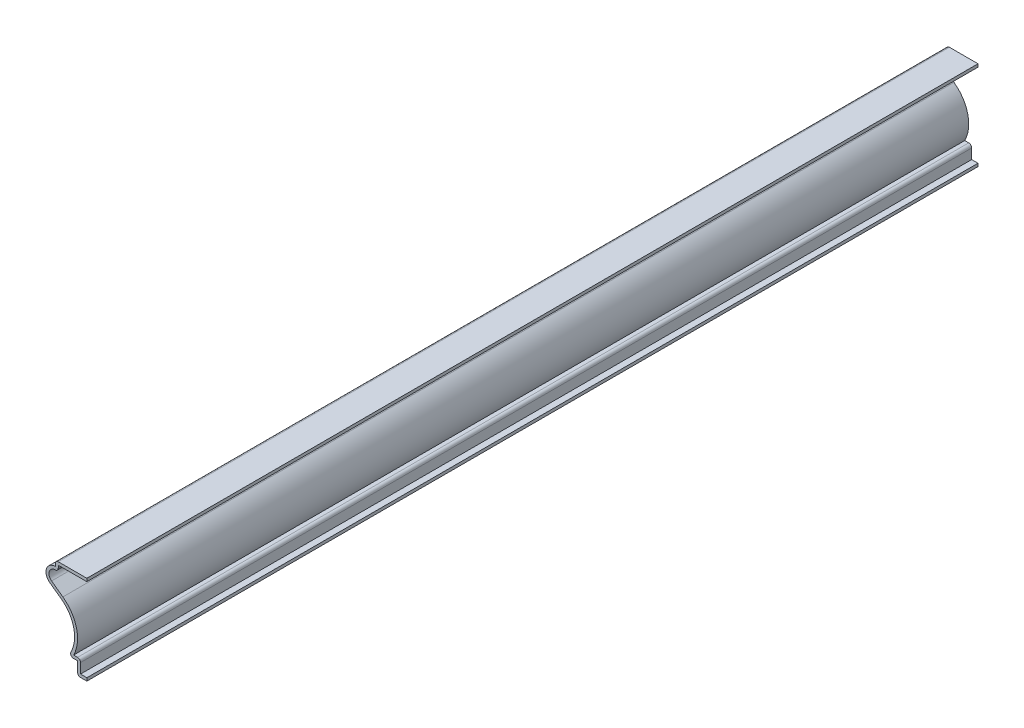
ISO-10303-21;
HEADER;
FILE_DESCRIPTION(('STEP AP214'),'2;1');
FILE_NAME('part.step','',(''),(''),'','','');
FILE_SCHEMA(('AUTOMOTIVE_DESIGN { 1 0 10303 214 1 1 1 1 }'));
ENDSEC;
DATA;
#1=APPLICATION_CONTEXT('core data for automotive mechanical design processes');
#2=APPLICATION_PROTOCOL_DEFINITION('international standard','automotive_design',2000,#1);
#3=PRODUCT_CONTEXT('',#1,'mechanical');
#4=PRODUCT('Part','Part','',(#3));
#5=PRODUCT_RELATED_PRODUCT_CATEGORY('part','',(#4));
#6=PRODUCT_DEFINITION_FORMATION('','',#4);
#7=PRODUCT_DEFINITION_CONTEXT('part definition',#1,'design');
#8=PRODUCT_DEFINITION('design','',#6,#7);
#9=PRODUCT_DEFINITION_SHAPE('','',#8);
#10=(LENGTH_UNIT() NAMED_UNIT(*) SI_UNIT(.MILLI.,.METRE.));
#11=(NAMED_UNIT(*) PLANE_ANGLE_UNIT() SI_UNIT($,.RADIAN.));
#12=(NAMED_UNIT(*) SI_UNIT($,.STERADIAN.) SOLID_ANGLE_UNIT());
#13=UNCERTAINTY_MEASURE_WITH_UNIT(LENGTH_MEASURE(1.E-05),#10,'distance_accuracy_value','');
#14=(GEOMETRIC_REPRESENTATION_CONTEXT(3) GLOBAL_UNCERTAINTY_ASSIGNED_CONTEXT((#13)) GLOBAL_UNIT_ASSIGNED_CONTEXT((#10,
#11,#12)) REPRESENTATION_CONTEXT('',''));
#15=CARTESIAN_POINT('',(0.,0.,0.));
#16=DIRECTION('',(0.,0.,1.));
#17=DIRECTION('',(1.,0.,0.));
#18=AXIS2_PLACEMENT_3D('',#15,#16,#17);
#19=CARTESIAN_POINT('',(0.,0.,-381.));
#20=DIRECTION('',(0.,-1.,0.));
#21=DIRECTION('',(0.,0.,-1.));
#22=AXIS2_PLACEMENT_3D('',#19,#20,#21);
#23=PLANE('',#22);
#24=DIRECTION('',(1.,0.,0.));
#25=VECTOR('',#24,1.);
#26=CARTESIAN_POINT('',(0.,0.,0.));
#27=LINE('',#26,#25);
#28=CARTESIAN_POINT('',(-2.69875,0.,0.));
#29=VERTEX_POINT('',#28);
#30=CARTESIAN_POINT('',(0.,0.,0.));
#31=VERTEX_POINT('',#30);
#32=EDGE_CURVE('E344',#29,#31,#27,.T.);
#33=ORIENTED_EDGE('',*,*,#32,.F.);
#34=DIRECTION('',(0.,0.,1.));
#35=VECTOR('',#34,1.);
#36=CARTESIAN_POINT('',(-2.69875,0.,-381.));
#37=LINE('',#36,#35);
#38=CARTESIAN_POINT('',(-2.69875,0.,-381.));
#39=VERTEX_POINT('',#38);
#40=EDGE_CURVE('E197',#29,#39,#37,.F.);
#41=ORIENTED_EDGE('',*,*,#40,.T.);
#42=DIRECTION('',(1.,0.,0.));
#43=VECTOR('',#42,1.);
#44=CARTESIAN_POINT('',(0.,0.,-381.));
#45=LINE('',#44,#43);
#46=CARTESIAN_POINT('',(0.,0.,-381.));
#47=VERTEX_POINT('',#46);
#48=EDGE_CURVE('E190',#39,#47,#45,.T.);
#49=ORIENTED_EDGE('',*,*,#48,.T.);
#50=DIRECTION('',(0.,0.,1.));
#51=VECTOR('',#50,1.);
#52=CARTESIAN_POINT('',(0.,0.,-381.));
#53=LINE('',#52,#51);
#54=EDGE_CURVE('E194',#47,#31,#53,.T.);
#55=ORIENTED_EDGE('',*,*,#54,.T.);
#56=EDGE_LOOP('',(#33,#41,#49,#55));
#57=FACE_BOUND('',#56,.T.);
#58=ADVANCED_FACE('F35',(#57),#23,.T.);
#59=CARTESIAN_POINT('',(-3.96875,0.,-381.));
#60=DIRECTION('',(-1.,0.,0.));
#61=DIRECTION('',(0.,0.,1.));
#62=AXIS2_PLACEMENT_3D('',#59,#60,#61);
#63=PLANE('',#62);
#64=DIRECTION('',(0.,-1.,0.));
#65=VECTOR('',#64,1.);
#66=CARTESIAN_POINT('',(-3.96875,0.,-381.));
#67=LINE('',#66,#65);
#68=CARTESIAN_POINT('',(-3.96875,5.55625,-381.));
#69=VERTEX_POINT('',#68);
#70=CARTESIAN_POINT('',(-3.96875,1.27,-381.));
#71=VERTEX_POINT('',#70);
#72=EDGE_CURVE('E215',#69,#71,#67,.T.);
#73=ORIENTED_EDGE('',*,*,#72,.T.);
#74=DIRECTION('',(0.,0.,1.));
#75=VECTOR('',#74,1.);
#76=CARTESIAN_POINT('',(-3.96875,1.27,-381.));
#77=LINE('',#76,#75);
#78=CARTESIAN_POINT('',(-3.96875,1.27,0.));
#79=VERTEX_POINT('',#78);
#80=EDGE_CURVE('E249',#71,#79,#77,.T.);
#81=ORIENTED_EDGE('',*,*,#80,.T.);
#82=DIRECTION('',(0.,-1.,0.));
#83=VECTOR('',#82,1.);
#84=CARTESIAN_POINT('',(-3.96875,0.,0.));
#85=LINE('',#84,#83);
#86=CARTESIAN_POINT('',(-3.96875,5.55625,0.));
#87=VERTEX_POINT('',#86);
#88=EDGE_CURVE('E200',#87,#79,#85,.T.);
#89=ORIENTED_EDGE('',*,*,#88,.F.);
#90=DIRECTION('',(0.,0.,1.));
#91=VECTOR('',#90,1.);
#92=CARTESIAN_POINT('',(-3.96875,5.55625,-381.));
#93=LINE('',#92,#91);
#94=EDGE_CURVE('E228',#69,#87,#93,.T.);
#95=ORIENTED_EDGE('',*,*,#94,.F.);
#96=EDGE_LOOP('',(#73,#81,#89,#95));
#97=FACE_BOUND('',#96,.T.);
#98=ADVANCED_FACE('F402',(#97),#63,.T.);
#99=CARTESIAN_POINT('',(-3.96875,5.55625,-381.));
#100=DIRECTION('',(0.,-1.,0.));
#101=DIRECTION('',(1.,0.,0.));
#102=AXIS2_PLACEMENT_3D('',#99,#100,#101);
#103=PLANE('',#102);
#104=DIRECTION('',(1.,0.,0.));
#105=VECTOR('',#104,1.);
#106=CARTESIAN_POINT('',(-3.96875,5.55625,0.));
#107=LINE('',#106,#105);
#108=CARTESIAN_POINT('',(-5.65948086373111,5.55625,0.));
#109=VERTEX_POINT('',#108);
#110=EDGE_CURVE('E304',#109,#87,#107,.T.);
#111=ORIENTED_EDGE('',*,*,#110,.F.);
#112=DIRECTION('',(0.,0.,1.));
#113=VECTOR('',#112,1.);
#114=CARTESIAN_POINT('',(-5.65948086373111,5.55625,-381.));
#115=LINE('',#114,#113);
#116=CARTESIAN_POINT('',(-5.65948086373111,5.55625,-381.));
#117=VERTEX_POINT('',#116);
#118=EDGE_CURVE('E256',#109,#117,#115,.F.);
#119=ORIENTED_EDGE('',*,*,#118,.T.);
#120=DIRECTION('',(1.,0.,0.));
#121=VECTOR('',#120,1.);
#122=CARTESIAN_POINT('',(-3.96875,5.55625,-381.));
#123=LINE('',#122,#121);
#124=EDGE_CURVE('E220',#117,#69,#123,.T.);
#125=ORIENTED_EDGE('',*,*,#124,.T.);
#126=ORIENTED_EDGE('',*,*,#94,.T.);
#127=EDGE_LOOP('',(#111,#119,#125,#126));
#128=FACE_BOUND('',#127,.T.);
#129=ADVANCED_FACE('F406',(#128),#103,.T.);
#130=CARTESIAN_POINT('',(-19.129375,13.7837281601047,-381.));
#131=DIRECTION('',(0.,0.,1.));
#132=DIRECTION('',(1.,0.,0.));
#133=AXIS2_PLACEMENT_3D('',#130,#131,#132);
#134=CYLINDRICAL_SURFACE('',#133,13.890625);
#135=CARTESIAN_POINT('',(-19.129375,13.7837281601047,-381.));
#136=DIRECTION('',(0.,0.,-1.));
#137=DIRECTION('',(1.,0.,0.));
#138=AXIS2_PLACEMENT_3D('',#135,#136,#137);
#139=CIRCLE('',#138,13.890625);
#140=CARTESIAN_POINT('',(-10.9868834914436,25.0375850511315,-381.));
#141=VERTEX_POINT('',#140);
#142=CARTESIAN_POINT('',(-6.78784895891594,7.40907539561086,-381.));
#143=VERTEX_POINT('',#142);
#144=EDGE_CURVE('E392',#141,#143,#139,.T.);
#145=ORIENTED_EDGE('',*,*,#144,.T.);
#146=DIRECTION('',(0.,0.,1.));
#147=VECTOR('',#146,1.);
#148=CARTESIAN_POINT('',(-6.78784895891594,7.40907539561086,-381.));
#149=LINE('',#148,#147);
#150=CARTESIAN_POINT('',(-6.78784895891594,7.40907539561086,0.));
#151=VERTEX_POINT('',#150);
#152=EDGE_CURVE('E253',#143,#151,#149,.T.);
#153=ORIENTED_EDGE('',*,*,#152,.T.);
#154=CARTESIAN_POINT('',(-19.129375,13.7837281601047,0.));
#155=DIRECTION('',(0.,0.,-1.));
#156=DIRECTION('',(1.,0.,0.));
#157=AXIS2_PLACEMENT_3D('',#154,#155,#156);
#158=CIRCLE('',#157,13.890625);
#159=CARTESIAN_POINT('',(-10.9868834914436,25.0375850511315,0.));
#160=VERTEX_POINT('',#159);
#161=EDGE_CURVE('E301',#160,#151,#158,.T.);
#162=ORIENTED_EDGE('',*,*,#161,.F.);
#163=DIRECTION('',(0.,0.,1.));
#164=VECTOR('',#163,1.);
#165=CARTESIAN_POINT('',(-10.9868834914436,25.0375850511315,-381.));
#166=LINE('',#165,#164);
#167=EDGE_CURVE('E310',#141,#160,#166,.T.);
#168=ORIENTED_EDGE('',*,*,#167,.F.);
#169=EDGE_LOOP('',(#145,#153,#162,#168));
#170=FACE_BOUND('',#169,.T.);
#171=ADVANCED_FACE('F415',(#170),#134,.F.);
#172=CARTESIAN_POINT('',(-15.8201761453018,28.5346123168495,-381.));
#173=DIRECTION('',(-0.586186115351641,-0.81017642410092,0.));
#174=DIRECTION('',(0.81017642410092,-0.586186115351641,0.));
#175=AXIS2_PLACEMENT_3D('',#172,#173,#174);
#176=PLANE('',#175);
#177=DIRECTION('',(0.81017642410092,-0.586186115351641,0.));
#178=VECTOR('',#177,1.);
#179=CARTESIAN_POINT('',(-15.8201761453018,28.5346123168495,0.));
#180=LINE('',#179,#178);
#181=CARTESIAN_POINT('',(-15.8201761453018,28.5346123168495,0.));
#182=VERTEX_POINT('',#181);
#183=EDGE_CURVE('E298',#182,#160,#180,.T.);
#184=ORIENTED_EDGE('',*,*,#183,.F.);
#185=DIRECTION('',(0.,0.,1.));
#186=VECTOR('',#185,1.);
#187=CARTESIAN_POINT('',(-15.8201761453018,28.5346123168495,-381.));
#188=LINE('',#187,#186);
#189=CARTESIAN_POINT('',(-15.8201761453018,28.5346123168495,-381.));
#190=VERTEX_POINT('',#189);
#191=EDGE_CURVE('E312',#190,#182,#188,.T.);
#192=ORIENTED_EDGE('',*,*,#191,.F.);
#193=DIRECTION('',(0.81017642410092,-0.586186115351641,0.));
#194=VECTOR('',#193,1.);
#195=CARTESIAN_POINT('',(-15.8201761453018,28.5346123168495,-381.));
#196=LINE('',#195,#194);
#197=EDGE_CURVE('E389',#190,#141,#196,.T.);
#198=ORIENTED_EDGE('',*,*,#197,.T.);
#199=ORIENTED_EDGE('',*,*,#167,.T.);
#200=EDGE_LOOP('',(#184,#192,#198,#199));
#201=FACE_BOUND('',#200,.T.);
#202=ADVANCED_FACE('F419',(#201),#176,.T.);
#203=CARTESIAN_POINT('',(-13.49375,31.75,-381.));
#204=DIRECTION('',(0.,0.,1.));
#205=DIRECTION('',(1.,0.,0.));
#206=AXIS2_PLACEMENT_3D('',#203,#204,#205);
#207=CYLINDRICAL_SURFACE('',#206,3.96875000000001);
#208=CARTESIAN_POINT('',(-13.49375,31.75,0.));
#209=DIRECTION('',(0.,0.,1.));
#210=DIRECTION('',(1.,0.,0.));
#211=AXIS2_PLACEMENT_3D('',#208,#209,#210);
#212=CIRCLE('',#211,3.96875000000001);
#213=CARTESIAN_POINT('',(-13.49375,35.71875,0.));
#214=VERTEX_POINT('',#213);
#215=EDGE_CURVE('E295',#214,#182,#212,.T.);
#216=ORIENTED_EDGE('',*,*,#215,.F.);
#217=DIRECTION('',(0.,0.,1.));
#218=VECTOR('',#217,1.);
#219=CARTESIAN_POINT('',(-13.49375,35.71875,-381.));
#220=LINE('',#219,#218);
#221=CARTESIAN_POINT('',(-13.49375,35.71875,-381.));
#222=VERTEX_POINT('',#221);
#223=EDGE_CURVE('E314',#222,#214,#220,.T.);
#224=ORIENTED_EDGE('',*,*,#223,.F.);
#225=CARTESIAN_POINT('',(-13.49375,31.75,-381.));
#226=DIRECTION('',(0.,0.,1.));
#227=DIRECTION('',(1.,0.,0.));
#228=AXIS2_PLACEMENT_3D('',#225,#226,#227);
#229=CIRCLE('',#228,3.96875000000001);
#230=EDGE_CURVE('E386',#222,#190,#229,.T.);
#231=ORIENTED_EDGE('',*,*,#230,.T.);
#232=ORIENTED_EDGE('',*,*,#191,.T.);
#233=EDGE_LOOP('',(#216,#224,#231,#232));
#234=FACE_BOUND('',#233,.T.);
#235=ADVANCED_FACE('F425',(#234),#207,.T.);
#236=CARTESIAN_POINT('',(-13.49375,38.1,-381.));
#237=DIRECTION('',(-1.,0.,0.));
#238=DIRECTION('',(0.,-1.,0.));
#239=AXIS2_PLACEMENT_3D('',#236,#237,#238);
#240=PLANE('',#239);
#241=DIRECTION('',(0.,-1.,0.));
#242=VECTOR('',#241,1.);
#243=CARTESIAN_POINT('',(-13.49375,38.1,0.));
#244=LINE('',#243,#242);
#245=CARTESIAN_POINT('',(-13.49375,36.83,0.));
#246=VERTEX_POINT('',#245);
#247=EDGE_CURVE('E293',#246,#214,#244,.T.);
#248=ORIENTED_EDGE('',*,*,#247,.F.);
#249=DIRECTION('',(0.,0.,1.));
#250=VECTOR('',#249,1.);
#251=CARTESIAN_POINT('',(-13.49375,36.83,-381.));
#252=LINE('',#251,#250);
#253=CARTESIAN_POINT('',(-13.49375,36.83,-381.));
#254=VERTEX_POINT('',#253);
#255=EDGE_CURVE('E261',#246,#254,#252,.F.);
#256=ORIENTED_EDGE('',*,*,#255,.T.);
#257=DIRECTION('',(0.,-1.,0.));
#258=VECTOR('',#257,1.);
#259=CARTESIAN_POINT('',(-13.49375,38.1,-381.));
#260=LINE('',#259,#258);
#261=EDGE_CURVE('E384',#254,#222,#260,.T.);
#262=ORIENTED_EDGE('',*,*,#261,.T.);
#263=ORIENTED_EDGE('',*,*,#223,.T.);
#264=EDGE_LOOP('',(#248,#256,#262,#263));
#265=FACE_BOUND('',#264,.T.);
#266=ADVANCED_FACE('F428',(#265),#240,.T.);
#267=CARTESIAN_POINT('',(0.,38.1,-381.));
#268=DIRECTION('',(0.,1.,0.));
#269=DIRECTION('',(0.,0.,1.));
#270=AXIS2_PLACEMENT_3D('',#267,#268,#269);
#271=PLANE('',#270);
#272=DIRECTION('',(-1.,0.,0.));
#273=VECTOR('',#272,1.);
#274=CARTESIAN_POINT('',(0.,38.1,-381.));
#275=LINE('',#274,#273);
#276=CARTESIAN_POINT('',(0.,38.1,-381.));
#277=VERTEX_POINT('',#276);
#278=CARTESIAN_POINT('',(-12.22375,38.1,-381.));
#279=VERTEX_POINT('',#278);
#280=EDGE_CURVE('E381',#277,#279,#275,.T.);
#281=ORIENTED_EDGE('',*,*,#280,.T.);
#282=DIRECTION('',(0.,0.,1.));
#283=VECTOR('',#282,1.);
#284=CARTESIAN_POINT('',(-12.22375,38.1,-381.));
#285=LINE('',#284,#283);
#286=CARTESIAN_POINT('',(-12.22375,38.1,0.));
#287=VERTEX_POINT('',#286);
#288=EDGE_CURVE('E258',#279,#287,#285,.T.);
#289=ORIENTED_EDGE('',*,*,#288,.T.);
#290=DIRECTION('',(-1.,0.,0.));
#291=VECTOR('',#290,1.);
#292=CARTESIAN_POINT('',(0.,38.1,0.));
#293=LINE('',#292,#291);
#294=CARTESIAN_POINT('',(0.,38.1,0.));
#295=VERTEX_POINT('',#294);
#296=EDGE_CURVE('E290',#295,#287,#293,.T.);
#297=ORIENTED_EDGE('',*,*,#296,.F.);
#298=DIRECTION('',(0.,0.,1.));
#299=VECTOR('',#298,1.);
#300=CARTESIAN_POINT('',(0.,38.1,-381.));
#301=LINE('',#300,#299);
#302=EDGE_CURVE('E317',#277,#295,#301,.T.);
#303=ORIENTED_EDGE('',*,*,#302,.F.);
#304=EDGE_LOOP('',(#281,#289,#297,#303));
#305=FACE_BOUND('',#304,.T.);
#306=ADVANCED_FACE('F437',(#305),#271,.T.);
#307=CARTESIAN_POINT('',(0.,38.1,-381.));
#308=DIRECTION('',(-1.,0.,0.));
#309=DIRECTION('',(0.,0.,1.));
#310=AXIS2_PLACEMENT_3D('',#307,#308,#309);
#311=PLANE('',#310);
#312=DIRECTION('',(0.,-1.,0.));
#313=VECTOR('',#312,1.);
#314=CARTESIAN_POINT('',(0.,38.1,0.));
#315=LINE('',#314,#313);
#316=CARTESIAN_POINT('',(0.,36.83,0.));
#317=VERTEX_POINT('',#316);
#318=EDGE_CURVE('E288',#295,#317,#315,.T.);
#319=ORIENTED_EDGE('',*,*,#318,.T.);
#320=DIRECTION('',(0.,0.,1.));
#321=VECTOR('',#320,1.);
#322=CARTESIAN_POINT('',(0.,36.83,-381.));
#323=LINE('',#322,#321);
#324=CARTESIAN_POINT('',(0.,36.83,-381.));
#325=VERTEX_POINT('',#324);
#326=EDGE_CURVE('E319',#325,#317,#323,.T.);
#327=ORIENTED_EDGE('',*,*,#326,.F.);
#328=DIRECTION('',(0.,-1.,0.));
#329=VECTOR('',#328,1.);
#330=CARTESIAN_POINT('',(0.,38.1,-381.));
#331=LINE('',#330,#329);
#332=EDGE_CURVE('E379',#277,#325,#331,.T.);
#333=ORIENTED_EDGE('',*,*,#332,.F.);
#334=ORIENTED_EDGE('',*,*,#302,.T.);
#335=EDGE_LOOP('',(#319,#327,#333,#334));
#336=FACE_BOUND('',#335,.T.);
#337=ADVANCED_FACE('F442',(#336),#311,.F.);
#338=CARTESIAN_POINT('',(0.,36.83,-381.));
#339=DIRECTION('',(0.,1.,0.));
#340=DIRECTION('',(0.,0.,1.));
#341=AXIS2_PLACEMENT_3D('',#338,#339,#340);
#342=PLANE('',#341);
#343=DIRECTION('',(1.,0.,0.));
#344=VECTOR('',#343,1.);
#345=CARTESIAN_POINT('',(0.,36.83,0.));
#346=LINE('',#345,#344);
#347=CARTESIAN_POINT('',(-12.22375,36.83,0.));
#348=VERTEX_POINT('',#347);
#349=EDGE_CURVE('E281',#317,#348,#346,.F.);
#350=ORIENTED_EDGE('',*,*,#349,.T.);
#351=DIRECTION('',(0.,0.,1.));
#352=VECTOR('',#351,1.);
#353=CARTESIAN_POINT('',(-12.22375,36.83,-381.));
#354=LINE('',#353,#352);
#355=CARTESIAN_POINT('',(-12.22375,36.83,-381.));
#356=VERTEX_POINT('',#355);
#357=EDGE_CURVE('E322',#356,#348,#354,.T.);
#358=ORIENTED_EDGE('',*,*,#357,.F.);
#359=DIRECTION('',(1.,0.,0.));
#360=VECTOR('',#359,1.);
#361=CARTESIAN_POINT('',(0.,36.83,-381.));
#362=LINE('',#361,#360);
#363=EDGE_CURVE('E377',#325,#356,#362,.F.);
#364=ORIENTED_EDGE('',*,*,#363,.F.);
#365=ORIENTED_EDGE('',*,*,#326,.T.);
#366=EDGE_LOOP('',(#350,#358,#364,#365));
#367=FACE_BOUND('',#366,.T.);
#368=ADVANCED_FACE('F446',(#367),#342,.F.);
#369=CARTESIAN_POINT('',(-12.22375,38.1,-381.));
#370=DIRECTION('',(-1.,0.,0.));
#371=DIRECTION('',(0.,-1.,0.));
#372=AXIS2_PLACEMENT_3D('',#369,#370,#371);
#373=PLANE('',#372);
#374=DIRECTION('',(0.,-1.,0.));
#375=VECTOR('',#374,1.);
#376=CARTESIAN_POINT('',(-12.22375,38.1,0.));
#377=LINE('',#376,#375);
#378=CARTESIAN_POINT('',(-12.22375,35.71875,0.));
#379=VERTEX_POINT('',#378);
#380=EDGE_CURVE('E279',#348,#379,#377,.T.);
#381=ORIENTED_EDGE('',*,*,#380,.T.);
#382=DIRECTION('',(0.,0.,1.));
#383=VECTOR('',#382,1.);
#384=CARTESIAN_POINT('',(-12.22375,35.71875,-381.));
#385=LINE('',#384,#383);
#386=CARTESIAN_POINT('',(-12.22375,35.71875,-381.));
#387=VERTEX_POINT('',#386);
#388=EDGE_CURVE('E11',#379,#387,#385,.F.);
#389=ORIENTED_EDGE('',*,*,#388,.T.);
#390=DIRECTION('',(0.,-1.,0.));
#391=VECTOR('',#390,1.);
#392=CARTESIAN_POINT('',(-12.22375,38.1,-381.));
#393=LINE('',#392,#391);
#394=EDGE_CURVE('E375',#356,#387,#393,.T.);
#395=ORIENTED_EDGE('',*,*,#394,.F.);
#396=ORIENTED_EDGE('',*,*,#357,.T.);
#397=EDGE_LOOP('',(#381,#389,#395,#396));
#398=FACE_BOUND('',#397,.T.);
#399=ADVANCED_FACE('F557',(#398),#373,.F.);
#400=CARTESIAN_POINT('',(-13.49375,31.75,-381.));
#401=DIRECTION('',(0.,0.,1.));
#402=DIRECTION('',(1.,0.,0.));
#403=AXIS2_PLACEMENT_3D('',#400,#401,#402);
#404=CYLINDRICAL_SURFACE('',#403,2.69875);
#405=CARTESIAN_POINT('',(-13.49375,31.75,-381.));
#406=DIRECTION('',(0.,0.,1.));
#407=DIRECTION('',(1.,0.,0.));
#408=AXIS2_PLACEMENT_3D('',#405,#406,#407);
#409=CIRCLE('',#408,2.69875);
#410=CARTESIAN_POINT('',(-13.49375,34.44875,-381.));
#411=VERTEX_POINT('',#410);
#412=CARTESIAN_POINT('',(-15.0757197788052,29.5635363754576,-381.));
#413=VERTEX_POINT('',#412);
#414=EDGE_CURVE('E270',#411,#413,#409,.T.);
#415=ORIENTED_EDGE('',*,*,#414,.F.);
#416=DIRECTION('',(0.,0.,1.));
#417=VECTOR('',#416,1.);
#418=CARTESIAN_POINT('',(-13.49375,34.44875,-381.));
#419=LINE('',#418,#417);
#420=CARTESIAN_POINT('',(-13.49375,34.44875,0.));
#421=VERTEX_POINT('',#420);
#422=EDGE_CURVE('E43',#411,#421,#419,.T.);
#423=ORIENTED_EDGE('',*,*,#422,.T.);
#424=CARTESIAN_POINT('',(-13.49375,31.75,0.));
#425=DIRECTION('',(0.,0.,1.));
#426=DIRECTION('',(1.,0.,0.));
#427=AXIS2_PLACEMENT_3D('',#424,#425,#426);
#428=CIRCLE('',#427,2.69875);
#429=CARTESIAN_POINT('',(-15.0757197788052,29.5635363754576,0.));
#430=VERTEX_POINT('',#429);
#431=EDGE_CURVE('E268',#421,#430,#428,.T.);
#432=ORIENTED_EDGE('',*,*,#431,.T.);
#433=DIRECTION('',(0.,0.,1.));
#434=VECTOR('',#433,1.);
#435=CARTESIAN_POINT('',(-15.0757197788052,29.5635363754576,-381.));
#436=LINE('',#435,#434);
#437=EDGE_CURVE('E325',#413,#430,#436,.T.);
#438=ORIENTED_EDGE('',*,*,#437,.F.);
#439=EDGE_LOOP('',(#415,#423,#432,#438));
#440=FACE_BOUND('',#439,.T.);
#441=ADVANCED_FACE('F266',(#440),#404,.F.);
#442=CARTESIAN_POINT('',(-15.0757197788052,29.5635363754576,-381.));
#443=DIRECTION('',(-0.586186115351641,-0.81017642410092,0.));
#444=DIRECTION('',(0.81017642410092,-0.586186115351641,0.));
#445=AXIS2_PLACEMENT_3D('',#442,#443,#444);
#446=PLANE('',#445);
#447=DIRECTION('',(0.81017642410092,-0.586186115351641,0.));
#448=VECTOR('',#447,1.);
#449=CARTESIAN_POINT('',(-15.0757197788052,29.5635363754576,0.));
#450=LINE('',#449,#448);
#451=CARTESIAN_POINT('',(-10.242427124947,26.0665091097397,0.));
#452=VERTEX_POINT('',#451);
#453=EDGE_CURVE('E278',#430,#452,#450,.T.);
#454=ORIENTED_EDGE('',*,*,#453,.T.);
#455=DIRECTION('',(0.,0.,1.));
#456=VECTOR('',#455,1.);
#457=CARTESIAN_POINT('',(-10.242427124947,26.0665091097397,-381.));
#458=LINE('',#457,#456);
#459=CARTESIAN_POINT('',(-10.242427124947,26.0665091097397,-381.));
#460=VERTEX_POINT('',#459);
#461=EDGE_CURVE('E327',#460,#452,#458,.T.);
#462=ORIENTED_EDGE('',*,*,#461,.F.);
#463=DIRECTION('',(0.81017642410092,-0.586186115351641,0.));
#464=VECTOR('',#463,1.);
#465=CARTESIAN_POINT('',(-15.0757197788052,29.5635363754576,-381.));
#466=LINE('',#465,#464);
#467=EDGE_CURVE('E372',#413,#460,#466,.T.);
#468=ORIENTED_EDGE('',*,*,#467,.F.);
#469=ORIENTED_EDGE('',*,*,#437,.T.);
#470=EDGE_LOOP('',(#454,#462,#468,#469));
#471=FACE_BOUND('',#470,.T.);
#472=ADVANCED_FACE('F541',(#471),#446,.F.);
#473=CARTESIAN_POINT('',(-19.129375,13.7837281601047,-381.));
#474=DIRECTION('',(0.,0.,1.));
#475=DIRECTION('',(1.,0.,0.));
#476=AXIS2_PLACEMENT_3D('',#473,#474,#475);
#477=CYLINDRICAL_SURFACE('',#476,15.160625);
#478=CARTESIAN_POINT('',(-19.129375,13.7837281601047,0.));
#479=DIRECTION('',(0.,0.,1.));
#480=DIRECTION('',(1.,0.,0.));
#481=AXIS2_PLACEMENT_3D('',#478,#479,#480);
#482=CIRCLE('',#481,15.160625);
#483=CARTESIAN_POINT('',(-5.65948086373111,6.82625,0.));
#484=VERTEX_POINT('',#483);
#485=EDGE_CURVE('E283',#452,#484,#482,.F.);
#486=ORIENTED_EDGE('',*,*,#485,.T.);
#487=DIRECTION('',(0.,0.,1.));
#488=VECTOR('',#487,1.);
#489=CARTESIAN_POINT('',(-5.65948086373111,6.82625,-381.));
#490=LINE('',#489,#488);
#491=CARTESIAN_POINT('',(-5.65948086373111,6.82625,-381.));
#492=VERTEX_POINT('',#491);
#493=EDGE_CURVE('E330',#492,#484,#490,.T.);
#494=ORIENTED_EDGE('',*,*,#493,.F.);
#495=CARTESIAN_POINT('',(-19.129375,13.7837281601047,-381.));
#496=DIRECTION('',(0.,0.,1.));
#497=DIRECTION('',(1.,0.,0.));
#498=AXIS2_PLACEMENT_3D('',#495,#496,#497);
#499=CIRCLE('',#498,15.160625);
#500=EDGE_CURVE('E367',#460,#492,#499,.F.);
#501=ORIENTED_EDGE('',*,*,#500,.F.);
#502=ORIENTED_EDGE('',*,*,#461,.T.);
#503=EDGE_LOOP('',(#486,#494,#501,#502));
#504=FACE_BOUND('',#503,.T.);
#505=ADVANCED_FACE('F351',(#504),#477,.T.);
#506=CARTESIAN_POINT('',(-3.96875,6.82625,-381.));
#507=DIRECTION('',(0.,-1.,0.));
#508=DIRECTION('',(1.,0.,0.));
#509=AXIS2_PLACEMENT_3D('',#506,#507,#508);
#510=PLANE('',#509);
#511=DIRECTION('',(1.,0.,0.));
#512=VECTOR('',#511,1.);
#513=CARTESIAN_POINT('',(-3.96875,6.82625,0.));
#514=LINE('',#513,#512);
#515=CARTESIAN_POINT('',(-3.96875,6.82625,0.));
#516=VERTEX_POINT('',#515);
#517=EDGE_CURVE('E342',#484,#516,#514,.T.);
#518=ORIENTED_EDGE('',*,*,#517,.T.);
#519=DIRECTION('',(0.,0.,1.));
#520=VECTOR('',#519,1.);
#521=CARTESIAN_POINT('',(-3.96875,6.82625,-381.));
#522=LINE('',#521,#520);
#523=CARTESIAN_POINT('',(-3.96875,6.82625,-381.));
#524=VERTEX_POINT('',#523);
#525=EDGE_CURVE('E238',#516,#524,#522,.F.);
#526=ORIENTED_EDGE('',*,*,#525,.T.);
#527=DIRECTION('',(1.,0.,0.));
#528=VECTOR('',#527,1.);
#529=CARTESIAN_POINT('',(-3.96875,6.82625,-381.));
#530=LINE('',#529,#528);
#531=EDGE_CURVE('E359',#492,#524,#530,.T.);
#532=ORIENTED_EDGE('',*,*,#531,.F.);
#533=ORIENTED_EDGE('',*,*,#493,.T.);
#534=EDGE_LOOP('',(#518,#526,#532,#533));
#535=FACE_BOUND('',#534,.T.);
#536=ADVANCED_FACE('F357',(#535),#510,.F.);
#537=CARTESIAN_POINT('',(-2.69875,0.,-381.));
#538=DIRECTION('',(-1.,0.,0.));
#539=DIRECTION('',(0.,0.,1.));
#540=AXIS2_PLACEMENT_3D('',#537,#538,#539);
#541=PLANE('',#540);
#542=DIRECTION('',(0.,1.,0.));
#543=VECTOR('',#542,1.);
#544=CARTESIAN_POINT('',(-2.69875,0.,-381.));
#545=LINE('',#544,#543);
#546=CARTESIAN_POINT('',(-2.69875,5.55625,-381.));
#547=VERTEX_POINT('',#546);
#548=CARTESIAN_POINT('',(-2.69875,1.27,-381.));
#549=VERTEX_POINT('',#548);
#550=EDGE_CURVE('E365',#547,#549,#545,.F.);
#551=ORIENTED_EDGE('',*,*,#550,.F.);
#552=DIRECTION('',(0.,0.,1.));
#553=VECTOR('',#552,1.);
#554=CARTESIAN_POINT('',(-2.69875,5.55625,-381.));
#555=LINE('',#554,#553);
#556=CARTESIAN_POINT('',(-2.69875,5.55625,0.));
#557=VERTEX_POINT('',#556);
#558=EDGE_CURVE('E224',#547,#557,#555,.T.);
#559=ORIENTED_EDGE('',*,*,#558,.T.);
#560=DIRECTION('',(0.,1.,0.));
#561=VECTOR('',#560,1.);
#562=CARTESIAN_POINT('',(-2.69875,0.,0.));
#563=LINE('',#562,#561);
#564=CARTESIAN_POINT('',(-2.69875,1.27,0.));
#565=VERTEX_POINT('',#564);
#566=EDGE_CURVE('E340',#557,#565,#563,.F.);
#567=ORIENTED_EDGE('',*,*,#566,.T.);
#568=DIRECTION('',(0.,0.,1.));
#569=VECTOR('',#568,1.);
#570=CARTESIAN_POINT('',(-2.69875,1.27,-381.));
#571=LINE('',#570,#569);
#572=EDGE_CURVE('E217',#549,#565,#571,.T.);
#573=ORIENTED_EDGE('',*,*,#572,.F.);
#574=EDGE_LOOP('',(#551,#559,#567,#573));
#575=FACE_BOUND('',#574,.T.);
#576=ADVANCED_FACE('F364',(#575),#541,.F.);
#577=CARTESIAN_POINT('',(0.,1.27,-381.));
#578=DIRECTION('',(0.,-1.,0.));
#579=DIRECTION('',(0.,0.,-1.));
#580=AXIS2_PLACEMENT_3D('',#577,#578,#579);
#581=PLANE('',#580);
#582=DIRECTION('',(1.,0.,0.));
#583=VECTOR('',#582,1.);
#584=CARTESIAN_POINT('',(0.,1.27,0.));
#585=LINE('',#584,#583);
#586=CARTESIAN_POINT('',(0.,1.27,0.));
#587=VERTEX_POINT('',#586);
#588=EDGE_CURVE('E337',#565,#587,#585,.T.);
#589=ORIENTED_EDGE('',*,*,#588,.T.);
#590=DIRECTION('',(0.,0.,1.));
#591=VECTOR('',#590,1.);
#592=CARTESIAN_POINT('',(0.,1.27,-381.));
#593=LINE('',#592,#591);
#594=CARTESIAN_POINT('',(0.,1.27,-381.));
#595=VERTEX_POINT('',#594);
#596=EDGE_CURVE('E214',#595,#587,#593,.T.);
#597=ORIENTED_EDGE('',*,*,#596,.F.);
#598=DIRECTION('',(1.,0.,0.));
#599=VECTOR('',#598,1.);
#600=CARTESIAN_POINT('',(0.,1.27,-381.));
#601=LINE('',#600,#599);
#602=EDGE_CURVE('E206',#549,#595,#601,.T.);
#603=ORIENTED_EDGE('',*,*,#602,.F.);
#604=ORIENTED_EDGE('',*,*,#572,.T.);
#605=EDGE_LOOP('',(#589,#597,#603,#604));
#606=FACE_BOUND('',#605,.T.);
#607=ADVANCED_FACE('F336',(#606),#581,.F.);
#608=CARTESIAN_POINT('',(0.,1.27,-381.));
#609=DIRECTION('',(-1.,0.,0.));
#610=DIRECTION('',(0.,0.,1.));
#611=AXIS2_PLACEMENT_3D('',#608,#609,#610);
#612=PLANE('',#611);
#613=DIRECTION('',(0.,-1.,0.));
#614=VECTOR('',#613,1.);
#615=CARTESIAN_POINT('',(0.,1.27,0.));
#616=LINE('',#615,#614);
#617=EDGE_CURVE('E213',#587,#31,#616,.T.);
#618=ORIENTED_EDGE('',*,*,#617,.T.);
#619=ORIENTED_EDGE('',*,*,#54,.F.);
#620=DIRECTION('',(0.,-1.,0.));
#621=VECTOR('',#620,1.);
#622=CARTESIAN_POINT('',(0.,1.27,-381.));
#623=LINE('',#622,#621);
#624=EDGE_CURVE('E199',#595,#47,#623,.T.);
#625=ORIENTED_EDGE('',*,*,#624,.F.);
#626=ORIENTED_EDGE('',*,*,#596,.T.);
#627=EDGE_LOOP('',(#618,#619,#625,#626));
#628=FACE_BOUND('',#627,.T.);
#629=ADVANCED_FACE('F211',(#628),#612,.F.);
#630=CARTESIAN_POINT('',(-19.129375,13.7837281601047,-381.));
#631=DIRECTION('',(0.,0.,1.));
#632=DIRECTION('',(1.,0.,0.));
#633=AXIS2_PLACEMENT_3D('',#630,#631,#632);
#634=PLANE('',#633);
#635=ORIENTED_EDGE('',*,*,#531,.T.);
#636=CARTESIAN_POINT('',(-3.96875,5.55625,-381.));
#637=DIRECTION('',(0.,0.,1.));
#638=DIRECTION('',(1.,0.,0.));
#639=AXIS2_PLACEMENT_3D('',#636,#637,#638);
#640=CIRCLE('',#639,1.27);
#641=EDGE_CURVE('E247',#524,#547,#640,.F.);
#642=ORIENTED_EDGE('',*,*,#641,.T.);
#643=ORIENTED_EDGE('',*,*,#550,.T.);
#644=ORIENTED_EDGE('',*,*,#602,.T.);
#645=ORIENTED_EDGE('',*,*,#624,.T.);
#646=ORIENTED_EDGE('',*,*,#48,.F.);
#647=CARTESIAN_POINT('',(-2.69875,1.27,-381.));
#648=DIRECTION('',(0.,0.,1.));
#649=DIRECTION('',(1.,0.,0.));
#650=AXIS2_PLACEMENT_3D('',#647,#648,#649);
#651=CIRCLE('',#650,1.27);
#652=EDGE_CURVE('E245',#39,#71,#651,.F.);
#653=ORIENTED_EDGE('',*,*,#652,.T.);
#654=ORIENTED_EDGE('',*,*,#72,.F.);
#655=ORIENTED_EDGE('',*,*,#124,.F.);
#656=CARTESIAN_POINT('',(-5.65948086373111,6.82625,-381.));
#657=DIRECTION('',(0.,0.,1.));
#658=DIRECTION('',(1.,0.,0.));
#659=AXIS2_PLACEMENT_3D('',#656,#657,#658);
#660=CIRCLE('',#659,1.27);
#661=EDGE_CURVE('E243',#117,#143,#660,.F.);
#662=ORIENTED_EDGE('',*,*,#661,.T.);
#663=ORIENTED_EDGE('',*,*,#144,.F.);
#664=ORIENTED_EDGE('',*,*,#197,.F.);
#665=ORIENTED_EDGE('',*,*,#230,.F.);
#666=ORIENTED_EDGE('',*,*,#261,.F.);
#667=CARTESIAN_POINT('',(-12.22375,36.83,-381.));
#668=DIRECTION('',(0.,0.,1.));
#669=DIRECTION('',(1.,0.,0.));
#670=AXIS2_PLACEMENT_3D('',#667,#668,#669);
#671=CIRCLE('',#670,1.27);
#672=EDGE_CURVE('E241',#254,#279,#671,.F.);
#673=ORIENTED_EDGE('',*,*,#672,.T.);
#674=ORIENTED_EDGE('',*,*,#280,.F.);
#675=ORIENTED_EDGE('',*,*,#332,.T.);
#676=ORIENTED_EDGE('',*,*,#363,.T.);
#677=ORIENTED_EDGE('',*,*,#394,.T.);
#678=CARTESIAN_POINT('',(-13.49375,35.71875,-381.));
#679=DIRECTION('',(0.,0.,1.));
#680=DIRECTION('',(1.,0.,0.));
#681=AXIS2_PLACEMENT_3D('',#678,#679,#680);
#682=CIRCLE('',#681,1.27);
#683=EDGE_CURVE('E50',#387,#411,#682,.F.);
#684=ORIENTED_EDGE('',*,*,#683,.T.);
#685=ORIENTED_EDGE('',*,*,#414,.T.);
#686=ORIENTED_EDGE('',*,*,#467,.T.);
#687=ORIENTED_EDGE('',*,*,#500,.T.);
#688=EDGE_LOOP('',(#635,#642,#643,#644,#645,#646,#653,#654,#655,#662,#663,#664,#665,#666,#673,
#674,#675,#676,#677,#684,#685,#686,#687));
#689=FACE_BOUND('',#688,.T.);
#690=ADVANCED_FACE('F204',(#689),#634,.F.);
#691=CARTESIAN_POINT('',(-19.129375,13.7837281601047,0.));
#692=DIRECTION('',(0.,0.,1.));
#693=DIRECTION('',(1.,0.,0.));
#694=AXIS2_PLACEMENT_3D('',#691,#692,#693);
#695=PLANE('',#694);
#696=ORIENTED_EDGE('',*,*,#566,.F.);
#697=CARTESIAN_POINT('',(-3.96875,5.55625,0.));
#698=DIRECTION('',(0.,0.,1.));
#699=DIRECTION('',(1.,0.,0.));
#700=AXIS2_PLACEMENT_3D('',#697,#698,#699);
#701=CIRCLE('',#700,1.27);
#702=EDGE_CURVE('E236',#557,#516,#701,.T.);
#703=ORIENTED_EDGE('',*,*,#702,.T.);
#704=ORIENTED_EDGE('',*,*,#517,.F.);
#705=ORIENTED_EDGE('',*,*,#485,.F.);
#706=ORIENTED_EDGE('',*,*,#453,.F.);
#707=ORIENTED_EDGE('',*,*,#431,.F.);
#708=CARTESIAN_POINT('',(-13.49375,35.71875,0.));
#709=DIRECTION('',(0.,0.,1.));
#710=DIRECTION('',(1.,0.,0.));
#711=AXIS2_PLACEMENT_3D('',#708,#709,#710);
#712=CIRCLE('',#711,1.27);
#713=EDGE_CURVE('E227',#421,#379,#712,.T.);
#714=ORIENTED_EDGE('',*,*,#713,.T.);
#715=ORIENTED_EDGE('',*,*,#380,.F.);
#716=ORIENTED_EDGE('',*,*,#349,.F.);
#717=ORIENTED_EDGE('',*,*,#318,.F.);
#718=ORIENTED_EDGE('',*,*,#296,.T.);
#719=CARTESIAN_POINT('',(-12.22375,36.83,0.));
#720=DIRECTION('',(0.,0.,1.));
#721=DIRECTION('',(1.,0.,0.));
#722=AXIS2_PLACEMENT_3D('',#719,#720,#721);
#723=CIRCLE('',#722,1.27);
#724=EDGE_CURVE('E230',#287,#246,#723,.T.);
#725=ORIENTED_EDGE('',*,*,#724,.T.);
#726=ORIENTED_EDGE('',*,*,#247,.T.);
#727=ORIENTED_EDGE('',*,*,#215,.T.);
#728=ORIENTED_EDGE('',*,*,#183,.T.);
#729=ORIENTED_EDGE('',*,*,#161,.T.);
#730=CARTESIAN_POINT('',(-5.65948086373111,6.82625,0.));
#731=DIRECTION('',(0.,0.,1.));
#732=DIRECTION('',(1.,0.,0.));
#733=AXIS2_PLACEMENT_3D('',#730,#731,#732);
#734=CIRCLE('',#733,1.27);
#735=EDGE_CURVE('E232',#151,#109,#734,.T.);
#736=ORIENTED_EDGE('',*,*,#735,.T.);
#737=ORIENTED_EDGE('',*,*,#110,.T.);
#738=ORIENTED_EDGE('',*,*,#88,.T.);
#739=CARTESIAN_POINT('',(-2.69875,1.27,0.));
#740=DIRECTION('',(0.,0.,1.));
#741=DIRECTION('',(1.,0.,0.));
#742=AXIS2_PLACEMENT_3D('',#739,#740,#741);
#743=CIRCLE('',#742,1.27);
#744=EDGE_CURVE('E234',#79,#29,#743,.T.);
#745=ORIENTED_EDGE('',*,*,#744,.T.);
#746=ORIENTED_EDGE('',*,*,#32,.T.);
#747=ORIENTED_EDGE('',*,*,#617,.F.);
#748=ORIENTED_EDGE('',*,*,#588,.F.);
#749=EDGE_LOOP('',(#696,#703,#704,#705,#706,#707,#714,#715,#716,#717,#718,#725,#726,#727,#728,
#729,#736,#737,#738,#745,#746,#747,#748));
#750=FACE_BOUND('',#749,.T.);
#751=ADVANCED_FACE('F275',(#750),#695,.T.);
#752=CARTESIAN_POINT('',(-3.96875,5.55625,-381.));
#753=DIRECTION('',(0.,0.,1.));
#754=DIRECTION('',(1.,0.,0.));
#755=AXIS2_PLACEMENT_3D('',#752,#753,#754);
#756=CYLINDRICAL_SURFACE('',#755,1.27);
#757=ORIENTED_EDGE('',*,*,#641,.F.);
#758=ORIENTED_EDGE('',*,*,#525,.F.);
#759=ORIENTED_EDGE('',*,*,#702,.F.);
#760=ORIENTED_EDGE('',*,*,#558,.F.);
#761=EDGE_LOOP('',(#757,#758,#759,#760));
#762=FACE_BOUND('',#761,.T.);
#763=ADVANCED_FACE('F363',(#762),#756,.T.);
#764=CARTESIAN_POINT('',(-2.69875,1.27,-381.));
#765=DIRECTION('',(0.,0.,1.));
#766=DIRECTION('',(1.,0.,0.));
#767=AXIS2_PLACEMENT_3D('',#764,#765,#766);
#768=CYLINDRICAL_SURFACE('',#767,1.27);
#769=ORIENTED_EDGE('',*,*,#652,.F.);
#770=ORIENTED_EDGE('',*,*,#40,.F.);
#771=ORIENTED_EDGE('',*,*,#744,.F.);
#772=ORIENTED_EDGE('',*,*,#80,.F.);
#773=EDGE_LOOP('',(#769,#770,#771,#772));
#774=FACE_BOUND('',#773,.T.);
#775=ADVANCED_FACE('F396',(#774),#768,.T.);
#776=CARTESIAN_POINT('',(-5.65948086373111,6.82625,-381.));
#777=DIRECTION('',(0.,0.,1.));
#778=DIRECTION('',(1.,0.,0.));
#779=AXIS2_PLACEMENT_3D('',#776,#777,#778);
#780=CYLINDRICAL_SURFACE('',#779,1.27);
#781=ORIENTED_EDGE('',*,*,#661,.F.);
#782=ORIENTED_EDGE('',*,*,#118,.F.);
#783=ORIENTED_EDGE('',*,*,#735,.F.);
#784=ORIENTED_EDGE('',*,*,#152,.F.);
#785=EDGE_LOOP('',(#781,#782,#783,#784));
#786=FACE_BOUND('',#785,.T.);
#787=ADVANCED_FACE('F412',(#786),#780,.T.);
#788=CARTESIAN_POINT('',(-12.22375,36.83,-381.));
#789=DIRECTION('',(0.,0.,1.));
#790=DIRECTION('',(1.,0.,0.));
#791=AXIS2_PLACEMENT_3D('',#788,#789,#790);
#792=CYLINDRICAL_SURFACE('',#791,1.27);
#793=ORIENTED_EDGE('',*,*,#672,.F.);
#794=ORIENTED_EDGE('',*,*,#255,.F.);
#795=ORIENTED_EDGE('',*,*,#724,.F.);
#796=ORIENTED_EDGE('',*,*,#288,.F.);
#797=EDGE_LOOP('',(#793,#794,#795,#796));
#798=FACE_BOUND('',#797,.T.);
#799=ADVANCED_FACE('F434',(#798),#792,.T.);
#800=CARTESIAN_POINT('',(-13.49375,35.71875,-381.));
#801=DIRECTION('',(0.,0.,1.));
#802=DIRECTION('',(1.,0.,0.));
#803=AXIS2_PLACEMENT_3D('',#800,#801,#802);
#804=CYLINDRICAL_SURFACE('',#803,1.27);
#805=ORIENTED_EDGE('',*,*,#683,.F.);
#806=ORIENTED_EDGE('',*,*,#388,.F.);
#807=ORIENTED_EDGE('',*,*,#713,.F.);
#808=ORIENTED_EDGE('',*,*,#422,.F.);
#809=EDGE_LOOP('',(#805,#806,#807,#808));
#810=FACE_BOUND('',#809,.T.);
#811=ADVANCED_FACE('F37',(#810),#804,.T.);
#812=CLOSED_SHELL('',(#58,#98,#129,#171,#202,#235,#266,#306,#337,#368,#399,#441,#472,#505,#536,
#576,#607,#629,#690,#751,#763,#775,#787,#799,#811));
#813=MANIFOLD_SOLID_BREP('B2',#812);
#814=ADVANCED_BREP_SHAPE_REPRESENTATION('',(#18,#813),#14);
#815=SHAPE_DEFINITION_REPRESENTATION(#9,#814);
ENDSEC;
END-ISO-10303-21;
